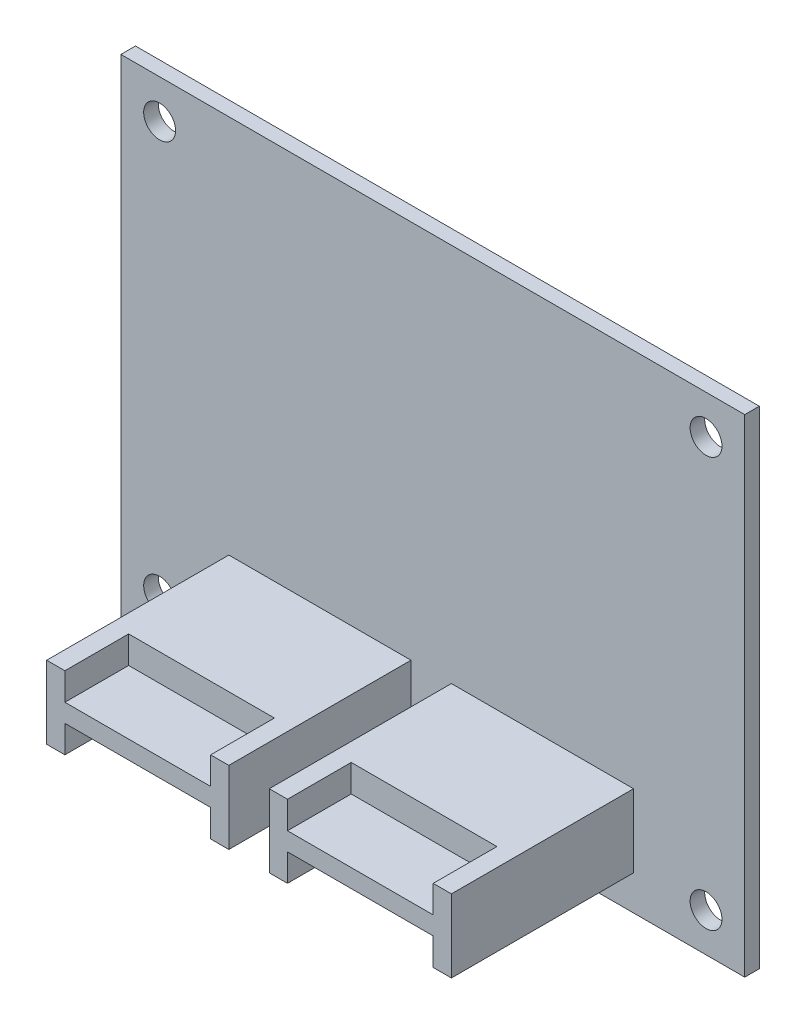
ISO-10303-21;
HEADER;
FILE_DESCRIPTION(('STEP AP214'),'2;1');
FILE_NAME('part.step','',(''),(''),'','','');
FILE_SCHEMA(('AUTOMOTIVE_DESIGN { 1 0 10303 214 1 1 1 1 }'));
ENDSEC;
DATA;
#1=APPLICATION_CONTEXT('core data for automotive mechanical design processes');
#2=APPLICATION_PROTOCOL_DEFINITION('international standard','automotive_design',2000,#1);
#3=PRODUCT_CONTEXT('',#1,'mechanical');
#4=PRODUCT('Part','Part','',(#3));
#5=PRODUCT_RELATED_PRODUCT_CATEGORY('part','',(#4));
#6=PRODUCT_DEFINITION_FORMATION('','',#4);
#7=PRODUCT_DEFINITION_CONTEXT('part definition',#1,'design');
#8=PRODUCT_DEFINITION('design','',#6,#7);
#9=PRODUCT_DEFINITION_SHAPE('','',#8);
#10=(LENGTH_UNIT() NAMED_UNIT(*) SI_UNIT(.MILLI.,.METRE.));
#11=(NAMED_UNIT(*) PLANE_ANGLE_UNIT() SI_UNIT($,.RADIAN.));
#12=(NAMED_UNIT(*) SI_UNIT($,.STERADIAN.) SOLID_ANGLE_UNIT());
#13=UNCERTAINTY_MEASURE_WITH_UNIT(LENGTH_MEASURE(1.E-05),#10,'distance_accuracy_value','');
#14=(GEOMETRIC_REPRESENTATION_CONTEXT(3) GLOBAL_UNCERTAINTY_ASSIGNED_CONTEXT((#13)) GLOBAL_UNIT_ASSIGNED_CONTEXT((#10,
#11,#12)) REPRESENTATION_CONTEXT('',''));
#15=CARTESIAN_POINT('',(0.,0.,0.));
#16=DIRECTION('',(0.,0.,1.));
#17=DIRECTION('',(1.,0.,0.));
#18=AXIS2_PLACEMENT_3D('',#15,#16,#17);
#19=CARTESIAN_POINT('',(0.,0.,0.8));
#20=DIRECTION('',(0.,0.,1.));
#21=DIRECTION('',(1.,0.,0.));
#22=AXIS2_PLACEMENT_3D('',#19,#20,#21);
#23=PLANE('',#22);
#24=CARTESIAN_POINT('',(-30.,-22.5,0.8));
#25=DIRECTION('',(0.,0.,1.));
#26=DIRECTION('',(1.,0.,0.));
#27=AXIS2_PLACEMENT_3D('',#24,#25,#26);
#28=CIRCLE('',#27,1.75);
#29=CARTESIAN_POINT('',(-28.25,-22.5,0.8));
#30=VERTEX_POINT('',#29);
#31=EDGE_CURVE('E491',#30,#30,#28,.T.);
#32=ORIENTED_EDGE('',*,*,#31,.F.);
#33=EDGE_LOOP('',(#32));
#34=FACE_BOUND('',#33,.T.);
#35=CARTESIAN_POINT('',(-30.,22.5,0.8));
#36=DIRECTION('',(0.,0.,1.));
#37=DIRECTION('',(1.,0.,0.));
#38=AXIS2_PLACEMENT_3D('',#35,#36,#37);
#39=CIRCLE('',#38,1.75);
#40=CARTESIAN_POINT('',(-28.25,22.5,0.8));
#41=VERTEX_POINT('',#40);
#42=EDGE_CURVE('E507',#41,#41,#39,.T.);
#43=ORIENTED_EDGE('',*,*,#42,.F.);
#44=EDGE_LOOP('',(#43));
#45=FACE_BOUND('',#44,.T.);
#46=DIRECTION('',(0.,-1.,0.));
#47=VECTOR('',#46,1.);
#48=CARTESIAN_POINT('',(-34.25,26.75,0.8));
#49=LINE('',#48,#47);
#50=CARTESIAN_POINT('',(-34.25,26.75,0.8));
#51=VERTEX_POINT('',#50);
#52=CARTESIAN_POINT('',(-34.25,-26.75,0.8));
#53=VERTEX_POINT('',#52);
#54=EDGE_CURVE('E515',#51,#53,#49,.T.);
#55=ORIENTED_EDGE('',*,*,#54,.T.);
#56=DIRECTION('',(1.,0.,0.));
#57=VECTOR('',#56,1.);
#58=CARTESIAN_POINT('',(-34.25,-26.75,0.8));
#59=LINE('',#58,#57);
#60=CARTESIAN_POINT('',(34.25,-26.75,0.8));
#61=VERTEX_POINT('',#60);
#62=EDGE_CURVE('E519',#53,#61,#59,.T.);
#63=ORIENTED_EDGE('',*,*,#62,.T.);
#64=DIRECTION('',(0.,1.,0.));
#65=VECTOR('',#64,1.);
#66=CARTESIAN_POINT('',(34.25,26.75,0.8));
#67=LINE('',#66,#65);
#68=CARTESIAN_POINT('',(34.25,26.75,0.8));
#69=VERTEX_POINT('',#68);
#70=EDGE_CURVE('E523',#61,#69,#67,.T.);
#71=ORIENTED_EDGE('',*,*,#70,.T.);
#72=DIRECTION('',(-1.,0.,0.));
#73=VECTOR('',#72,1.);
#74=CARTESIAN_POINT('',(-34.25,26.75,0.8));
#75=LINE('',#74,#73);
#76=EDGE_CURVE('E526',#69,#51,#75,.T.);
#77=ORIENTED_EDGE('',*,*,#76,.T.);
#78=EDGE_LOOP('',(#55,#63,#71,#77));
#79=FACE_BOUND('',#78,.T.);
#80=CARTESIAN_POINT('',(30.,22.5,0.8));
#81=DIRECTION('',(0.,0.,1.));
#82=DIRECTION('',(1.,0.,0.));
#83=AXIS2_PLACEMENT_3D('',#80,#81,#82);
#84=CIRCLE('',#83,1.75);
#85=CARTESIAN_POINT('',(31.75,22.5,0.8));
#86=VERTEX_POINT('',#85);
#87=EDGE_CURVE('E499',#86,#86,#84,.T.);
#88=ORIENTED_EDGE('',*,*,#87,.F.);
#89=EDGE_LOOP('',(#88));
#90=FACE_BOUND('',#89,.T.);
#91=CARTESIAN_POINT('',(30.,-22.5,0.8));
#92=DIRECTION('',(0.,0.,1.));
#93=DIRECTION('',(1.,0.,0.));
#94=AXIS2_PLACEMENT_3D('',#91,#92,#93);
#95=CIRCLE('',#94,1.75000000000001);
#96=CARTESIAN_POINT('',(31.75,-22.5,0.8));
#97=VERTEX_POINT('',#96);
#98=EDGE_CURVE('E483',#97,#97,#95,.T.);
#99=ORIENTED_EDGE('',*,*,#98,.F.);
#100=EDGE_LOOP('',(#99));
#101=FACE_BOUND('',#100,.T.);
#102=DIRECTION('',(1.,0.,0.));
#103=VECTOR('',#102,1.);
#104=CARTESIAN_POINT('',(-22.3993988063415,-22.9310366105022,0.8));
#105=LINE('',#104,#103);
#106=CARTESIAN_POINT('',(-22.3993988063415,-22.9310366105022,0.8));
#107=VERTEX_POINT('',#106);
#108=CARTESIAN_POINT('',(-2.39939880634145,-22.9310366105022,0.8));
#109=VERTEX_POINT('',#108);
#110=EDGE_CURVE('E460',#107,#109,#105,.T.);
#111=ORIENTED_EDGE('',*,*,#110,.F.);
#112=DIRECTION('',(0.,-1.,0.));
#113=VECTOR('',#112,1.);
#114=CARTESIAN_POINT('',(-22.3993988063415,-14.9310366105022,0.8));
#115=LINE('',#114,#113);
#116=CARTESIAN_POINT('',(-22.3993988063415,-14.9310366105022,0.8));
#117=VERTEX_POINT('',#116);
#118=EDGE_CURVE('E437',#117,#107,#115,.T.);
#119=ORIENTED_EDGE('',*,*,#118,.F.);
#120=DIRECTION('',(-1.,0.,0.));
#121=VECTOR('',#120,1.);
#122=CARTESIAN_POINT('',(-22.3993988063415,-14.9310366105022,0.8));
#123=LINE('',#122,#121);
#124=CARTESIAN_POINT('',(-2.39939880634145,-14.9310366105022,0.8));
#125=VERTEX_POINT('',#124);
#126=EDGE_CURVE('E443',#125,#117,#123,.T.);
#127=ORIENTED_EDGE('',*,*,#126,.F.);
#128=DIRECTION('',(0.,1.,0.));
#129=VECTOR('',#128,1.);
#130=CARTESIAN_POINT('',(-2.39939880634145,-14.9310366105022,0.8));
#131=LINE('',#130,#129);
#132=EDGE_CURVE('E463',#109,#125,#131,.T.);
#133=ORIENTED_EDGE('',*,*,#132,.F.);
#134=EDGE_LOOP('',(#111,#119,#127,#133));
#135=FACE_BOUND('',#134,.T.);
#136=DIRECTION('',(1.,0.,0.));
#137=VECTOR('',#136,1.);
#138=CARTESIAN_POINT('',(2.03976637548692,-22.9310366105022,0.8));
#139=LINE('',#138,#137);
#140=CARTESIAN_POINT('',(2.03976637548692,-22.9310366105022,0.8));
#141=VERTEX_POINT('',#140);
#142=CARTESIAN_POINT('',(22.0397663754869,-22.9310366105022,0.8));
#143=VERTEX_POINT('',#142);
#144=EDGE_CURVE('E415',#141,#143,#139,.T.);
#145=ORIENTED_EDGE('',*,*,#144,.F.);
#146=DIRECTION('',(0.,-1.,0.));
#147=VECTOR('',#146,1.);
#148=CARTESIAN_POINT('',(2.03976637548692,-14.9310366105022,0.8));
#149=LINE('',#148,#147);
#150=CARTESIAN_POINT('',(2.03976637548692,-14.9310366105022,0.8));
#151=VERTEX_POINT('',#150);
#152=EDGE_CURVE('E384',#151,#141,#149,.T.);
#153=ORIENTED_EDGE('',*,*,#152,.F.);
#154=DIRECTION('',(-1.,0.,0.));
#155=VECTOR('',#154,1.);
#156=CARTESIAN_POINT('',(2.03976637548692,-14.9310366105022,0.8));
#157=LINE('',#156,#155);
#158=CARTESIAN_POINT('',(22.0397663754869,-14.9310366105022,0.8));
#159=VERTEX_POINT('',#158);
#160=EDGE_CURVE('E399',#159,#151,#157,.T.);
#161=ORIENTED_EDGE('',*,*,#160,.F.);
#162=DIRECTION('',(0.,1.,0.));
#163=VECTOR('',#162,1.);
#164=CARTESIAN_POINT('',(22.0397663754869,-14.9310366105022,0.8));
#165=LINE('',#164,#163);
#166=EDGE_CURVE('E418',#143,#159,#165,.T.);
#167=ORIENTED_EDGE('',*,*,#166,.F.);
#168=EDGE_LOOP('',(#145,#153,#161,#167));
#169=FACE_BOUND('',#168,.T.);
#170=ADVANCED_FACE('F39',(#34,#45,#79,#90,#101,#135,#169),#23,.T.);
#171=CARTESIAN_POINT('',(0.,0.,-0.8));
#172=DIRECTION('',(0.,0.,1.));
#173=DIRECTION('',(1.,0.,0.));
#174=AXIS2_PLACEMENT_3D('',#171,#172,#173);
#175=PLANE('',#174);
#176=DIRECTION('',(0.,-1.,0.));
#177=VECTOR('',#176,1.);
#178=CARTESIAN_POINT('',(-34.25,26.75,-0.8));
#179=LINE('',#178,#177);
#180=CARTESIAN_POINT('',(-34.25,26.75,-0.8));
#181=VERTEX_POINT('',#180);
#182=CARTESIAN_POINT('',(-34.25,-26.75,-0.8));
#183=VERTEX_POINT('',#182);
#184=EDGE_CURVE('E511',#181,#183,#179,.T.);
#185=ORIENTED_EDGE('',*,*,#184,.F.);
#186=DIRECTION('',(-1.,0.,0.));
#187=VECTOR('',#186,1.);
#188=CARTESIAN_POINT('',(-34.25,26.75,-0.8));
#189=LINE('',#188,#187);
#190=CARTESIAN_POINT('',(34.25,26.75,-0.8));
#191=VERTEX_POINT('',#190);
#192=EDGE_CURVE('E520',#191,#181,#189,.T.);
#193=ORIENTED_EDGE('',*,*,#192,.F.);
#194=DIRECTION('',(0.,1.,0.));
#195=VECTOR('',#194,1.);
#196=CARTESIAN_POINT('',(34.25,26.75,-0.8));
#197=LINE('',#196,#195);
#198=CARTESIAN_POINT('',(34.25,-26.75,-0.8));
#199=VERTEX_POINT('',#198);
#200=EDGE_CURVE('E536',#199,#191,#197,.T.);
#201=ORIENTED_EDGE('',*,*,#200,.F.);
#202=DIRECTION('',(1.,0.,0.));
#203=VECTOR('',#202,1.);
#204=CARTESIAN_POINT('',(-34.25,-26.75,-0.8));
#205=LINE('',#204,#203);
#206=EDGE_CURVE('E533',#183,#199,#205,.T.);
#207=ORIENTED_EDGE('',*,*,#206,.F.);
#208=EDGE_LOOP('',(#185,#193,#201,#207));
#209=FACE_BOUND('',#208,.T.);
#210=CARTESIAN_POINT('',(-30.,22.5,-0.8));
#211=DIRECTION('',(0.,0.,1.));
#212=DIRECTION('',(1.,0.,0.));
#213=AXIS2_PLACEMENT_3D('',#210,#211,#212);
#214=CIRCLE('',#213,1.75);
#215=CARTESIAN_POINT('',(-28.25,22.5,-0.8));
#216=VERTEX_POINT('',#215);
#217=EDGE_CURVE('E503',#216,#216,#214,.T.);
#218=ORIENTED_EDGE('',*,*,#217,.T.);
#219=EDGE_LOOP('',(#218));
#220=FACE_BOUND('',#219,.T.);
#221=CARTESIAN_POINT('',(30.,22.5,-0.8));
#222=DIRECTION('',(0.,0.,1.));
#223=DIRECTION('',(1.,0.,0.));
#224=AXIS2_PLACEMENT_3D('',#221,#222,#223);
#225=CIRCLE('',#224,1.75);
#226=CARTESIAN_POINT('',(31.75,22.5,-0.8));
#227=VERTEX_POINT('',#226);
#228=EDGE_CURVE('E495',#227,#227,#225,.T.);
#229=ORIENTED_EDGE('',*,*,#228,.T.);
#230=EDGE_LOOP('',(#229));
#231=FACE_BOUND('',#230,.T.);
#232=CARTESIAN_POINT('',(-30.,-22.5,-0.8));
#233=DIRECTION('',(0.,0.,1.));
#234=DIRECTION('',(1.,0.,0.));
#235=AXIS2_PLACEMENT_3D('',#232,#233,#234);
#236=CIRCLE('',#235,1.75);
#237=CARTESIAN_POINT('',(-28.25,-22.5,-0.8));
#238=VERTEX_POINT('',#237);
#239=EDGE_CURVE('E487',#238,#238,#236,.T.);
#240=ORIENTED_EDGE('',*,*,#239,.T.);
#241=EDGE_LOOP('',(#240));
#242=FACE_BOUND('',#241,.T.);
#243=CARTESIAN_POINT('',(30.,-22.5,-0.8));
#244=DIRECTION('',(0.,0.,1.));
#245=DIRECTION('',(1.,0.,0.));
#246=AXIS2_PLACEMENT_3D('',#243,#244,#245);
#247=CIRCLE('',#246,1.75000000000001);
#248=CARTESIAN_POINT('',(31.75,-22.5,-0.8));
#249=VERTEX_POINT('',#248);
#250=EDGE_CURVE('E482',#249,#249,#247,.T.);
#251=ORIENTED_EDGE('',*,*,#250,.T.);
#252=EDGE_LOOP('',(#251));
#253=FACE_BOUND('',#252,.T.);
#254=ADVANCED_FACE('F559',(#209,#220,#231,#242,#253),#175,.F.);
#255=CARTESIAN_POINT('',(-34.25,26.75,0.8));
#256=DIRECTION('',(1.,0.,0.));
#257=DIRECTION('',(0.,1.,0.));
#258=AXIS2_PLACEMENT_3D('',#255,#256,#257);
#259=PLANE('',#258);
#260=ORIENTED_EDGE('',*,*,#184,.T.);
#261=DIRECTION('',(0.,0.,-1.));
#262=VECTOR('',#261,1.);
#263=CARTESIAN_POINT('',(-34.25,-26.75,0.8));
#264=LINE('',#263,#262);
#265=EDGE_CURVE('E11',#53,#183,#264,.T.);
#266=ORIENTED_EDGE('',*,*,#265,.F.);
#267=ORIENTED_EDGE('',*,*,#54,.F.);
#268=DIRECTION('',(0.,0.,-1.));
#269=VECTOR('',#268,1.);
#270=CARTESIAN_POINT('',(-34.25,26.75,0.8));
#271=LINE('',#270,#269);
#272=EDGE_CURVE('E529',#51,#181,#271,.T.);
#273=ORIENTED_EDGE('',*,*,#272,.T.);
#274=EDGE_LOOP('',(#260,#266,#267,#273));
#275=FACE_BOUND('',#274,.T.);
#276=ADVANCED_FACE('F41',(#275),#259,.F.);
#277=CARTESIAN_POINT('',(-34.25,-26.75,0.8));
#278=DIRECTION('',(0.,1.,0.));
#279=DIRECTION('',(0.,0.,1.));
#280=AXIS2_PLACEMENT_3D('',#277,#278,#279);
#281=PLANE('',#280);
#282=ORIENTED_EDGE('',*,*,#206,.T.);
#283=DIRECTION('',(0.,0.,-1.));
#284=VECTOR('',#283,1.);
#285=CARTESIAN_POINT('',(34.25,-26.75,0.8));
#286=LINE('',#285,#284);
#287=EDGE_CURVE('E48',#61,#199,#286,.T.);
#288=ORIENTED_EDGE('',*,*,#287,.F.);
#289=ORIENTED_EDGE('',*,*,#62,.F.);
#290=ORIENTED_EDGE('',*,*,#265,.T.);
#291=EDGE_LOOP('',(#282,#288,#289,#290));
#292=FACE_BOUND('',#291,.T.);
#293=ADVANCED_FACE('F570',(#292),#281,.F.);
#294=CARTESIAN_POINT('',(34.25,26.75,0.8));
#295=DIRECTION('',(-1.,0.,0.));
#296=DIRECTION('',(0.,0.,1.));
#297=AXIS2_PLACEMENT_3D('',#294,#295,#296);
#298=PLANE('',#297);
#299=ORIENTED_EDGE('',*,*,#200,.T.);
#300=DIRECTION('',(0.,0.,-1.));
#301=VECTOR('',#300,1.);
#302=CARTESIAN_POINT('',(34.25,26.75,0.8));
#303=LINE('',#302,#301);
#304=EDGE_CURVE('E544',#69,#191,#303,.T.);
#305=ORIENTED_EDGE('',*,*,#304,.F.);
#306=ORIENTED_EDGE('',*,*,#70,.F.);
#307=ORIENTED_EDGE('',*,*,#287,.T.);
#308=EDGE_LOOP('',(#299,#305,#306,#307));
#309=FACE_BOUND('',#308,.T.);
#310=ADVANCED_FACE('F553',(#309),#298,.F.);
#311=CARTESIAN_POINT('',(-34.25,26.75,0.8));
#312=DIRECTION('',(0.,-1.,0.));
#313=DIRECTION('',(0.,0.,-1.));
#314=AXIS2_PLACEMENT_3D('',#311,#312,#313);
#315=PLANE('',#314);
#316=ORIENTED_EDGE('',*,*,#192,.T.);
#317=ORIENTED_EDGE('',*,*,#272,.F.);
#318=ORIENTED_EDGE('',*,*,#76,.F.);
#319=ORIENTED_EDGE('',*,*,#304,.T.);
#320=EDGE_LOOP('',(#316,#317,#318,#319));
#321=FACE_BOUND('',#320,.T.);
#322=ADVANCED_FACE('F563',(#321),#315,.F.);
#323=CARTESIAN_POINT('',(-30.,22.5,0.8));
#324=DIRECTION('',(0.,0.,-1.));
#325=DIRECTION('',(-1.,0.,0.));
#326=AXIS2_PLACEMENT_3D('',#323,#324,#325);
#327=CYLINDRICAL_SURFACE('',#326,1.75);
#328=ORIENTED_EDGE('',*,*,#42,.T.);
#329=EDGE_LOOP('',(#328));
#330=FACE_BOUND('',#329,.T.);
#331=ORIENTED_EDGE('',*,*,#217,.F.);
#332=EDGE_LOOP('',(#331));
#333=FACE_BOUND('',#332,.T.);
#334=ADVANCED_FACE('F587',(#330,#333),#327,.F.);
#335=CARTESIAN_POINT('',(30.,22.5,0.8));
#336=DIRECTION('',(0.,0.,-1.));
#337=DIRECTION('',(-1.,0.,0.));
#338=AXIS2_PLACEMENT_3D('',#335,#336,#337);
#339=CYLINDRICAL_SURFACE('',#338,1.75);
#340=ORIENTED_EDGE('',*,*,#87,.T.);
#341=EDGE_LOOP('',(#340));
#342=FACE_BOUND('',#341,.T.);
#343=ORIENTED_EDGE('',*,*,#228,.F.);
#344=EDGE_LOOP('',(#343));
#345=FACE_BOUND('',#344,.T.);
#346=ADVANCED_FACE('F594',(#342,#345),#339,.F.);
#347=CARTESIAN_POINT('',(-30.,-22.5,0.8));
#348=DIRECTION('',(0.,0.,-1.));
#349=DIRECTION('',(-1.,0.,0.));
#350=AXIS2_PLACEMENT_3D('',#347,#348,#349);
#351=CYLINDRICAL_SURFACE('',#350,1.75);
#352=ORIENTED_EDGE('',*,*,#31,.T.);
#353=EDGE_LOOP('',(#352));
#354=FACE_BOUND('',#353,.T.);
#355=ORIENTED_EDGE('',*,*,#239,.F.);
#356=EDGE_LOOP('',(#355));
#357=FACE_BOUND('',#356,.T.);
#358=ADVANCED_FACE('F599',(#354,#357),#351,.F.);
#359=CARTESIAN_POINT('',(30.,-22.5,0.8));
#360=DIRECTION('',(0.,0.,-1.));
#361=DIRECTION('',(-1.,0.,0.));
#362=AXIS2_PLACEMENT_3D('',#359,#360,#361);
#363=CYLINDRICAL_SURFACE('',#362,1.75000000000001);
#364=ORIENTED_EDGE('',*,*,#98,.T.);
#365=EDGE_LOOP('',(#364));
#366=FACE_BOUND('',#365,.T.);
#367=ORIENTED_EDGE('',*,*,#250,.F.);
#368=EDGE_LOOP('',(#367));
#369=FACE_BOUND('',#368,.T.);
#370=ADVANCED_FACE('F611',(#366,#369),#363,.F.);
#371=CARTESIAN_POINT('',(-22.3993988063415,-14.9310366105022,20.8));
#372=DIRECTION('',(1.,0.,0.));
#373=DIRECTION('',(0.,0.,-1.));
#374=AXIS2_PLACEMENT_3D('',#371,#372,#373);
#375=PLANE('',#374);
#376=ORIENTED_EDGE('',*,*,#118,.T.);
#377=DIRECTION('',(0.,0.,-1.));
#378=VECTOR('',#377,1.);
#379=CARTESIAN_POINT('',(-22.3993988063415,-22.9310366105022,20.8));
#380=LINE('',#379,#378);
#381=CARTESIAN_POINT('',(-22.3993988063415,-22.9310366105022,20.8));
#382=VERTEX_POINT('',#381);
#383=EDGE_CURVE('E479',#382,#107,#380,.T.);
#384=ORIENTED_EDGE('',*,*,#383,.F.);
#385=DIRECTION('',(0.,-1.,0.));
#386=VECTOR('',#385,1.);
#387=CARTESIAN_POINT('',(-22.3993988063415,-14.9310366105022,20.8));
#388=LINE('',#387,#386);
#389=CARTESIAN_POINT('',(-22.3993988063415,-14.9310366105022,20.8));
#390=VERTEX_POINT('',#389);
#391=EDGE_CURVE('E438',#390,#382,#388,.T.);
#392=ORIENTED_EDGE('',*,*,#391,.F.);
#393=DIRECTION('',(0.,0.,-1.));
#394=VECTOR('',#393,1.);
#395=CARTESIAN_POINT('',(-22.3993988063415,-14.9310366105022,20.8));
#396=LINE('',#395,#394);
#397=EDGE_CURVE('E456',#390,#117,#396,.T.);
#398=ORIENTED_EDGE('',*,*,#397,.T.);
#399=EDGE_LOOP('',(#376,#384,#392,#398));
#400=FACE_BOUND('',#399,.T.);
#401=ADVANCED_FACE('F613',(#400),#375,.F.);
#402=CARTESIAN_POINT('',(-22.3993988063415,-22.9310366105022,20.8));
#403=DIRECTION('',(0.,1.,0.));
#404=DIRECTION('',(0.,0.,1.));
#405=AXIS2_PLACEMENT_3D('',#402,#403,#404);
#406=PLANE('',#405);
#407=DIRECTION('',(1.,0.,0.));
#408=VECTOR('',#407,1.);
#409=CARTESIAN_POINT('',(-20.3993988063415,-22.9310366105022,13.8));
#410=LINE('',#409,#408);
#411=CARTESIAN_POINT('',(-20.3993988063415,-22.9310366105022,13.8));
#412=VERTEX_POINT('',#411);
#413=CARTESIAN_POINT('',(-4.39939880634145,-22.9310366105022,13.8));
#414=VERTEX_POINT('',#413);
#415=EDGE_CURVE('E282',#412,#414,#410,.T.);
#416=ORIENTED_EDGE('',*,*,#415,.F.);
#417=DIRECTION('',(0.,0.,1.));
#418=VECTOR('',#417,1.);
#419=CARTESIAN_POINT('',(-20.3993988063415,-22.9310366105022,13.8));
#420=LINE('',#419,#418);
#421=CARTESIAN_POINT('',(-20.3993988063415,-22.9310366105022,20.8));
#422=VERTEX_POINT('',#421);
#423=EDGE_CURVE('E295',#412,#422,#420,.T.);
#424=ORIENTED_EDGE('',*,*,#423,.T.);
#425=DIRECTION('',(1.,0.,0.));
#426=VECTOR('',#425,1.);
#427=CARTESIAN_POINT('',(-22.3993988063415,-22.9310366105022,20.8));
#428=LINE('',#427,#426);
#429=EDGE_CURVE('E444',#382,#422,#428,.T.);
#430=ORIENTED_EDGE('',*,*,#429,.F.);
#431=ORIENTED_EDGE('',*,*,#383,.T.);
#432=ORIENTED_EDGE('',*,*,#110,.T.);
#433=DIRECTION('',(0.,0.,-1.));
#434=VECTOR('',#433,1.);
#435=CARTESIAN_POINT('',(-2.39939880634145,-22.9310366105022,20.8));
#436=LINE('',#435,#434);
#437=CARTESIAN_POINT('',(-2.39939880634145,-22.9310366105022,20.8));
#438=VERTEX_POINT('',#437);
#439=EDGE_CURVE('E475',#438,#109,#436,.T.);
#440=ORIENTED_EDGE('',*,*,#439,.F.);
#441=CARTESIAN_POINT('',(-4.39939880634145,-22.9310366105022,20.8));
#442=VERTEX_POINT('',#441);
#443=EDGE_CURVE('E442',#442,#438,#428,.T.);
#444=ORIENTED_EDGE('',*,*,#443,.F.);
#445=DIRECTION('',(0.,0.,1.));
#446=VECTOR('',#445,1.);
#447=CARTESIAN_POINT('',(-4.39939880634145,-22.9310366105022,13.8));
#448=LINE('',#447,#446);
#449=EDGE_CURVE('E63',#414,#442,#448,.T.);
#450=ORIENTED_EDGE('',*,*,#449,.F.);
#451=EDGE_LOOP('',(#416,#424,#430,#431,#432,#440,#444,#450));
#452=FACE_BOUND('',#451,.T.);
#453=ADVANCED_FACE('F620',(#452),#406,.F.);
#454=CARTESIAN_POINT('',(-2.39939880634145,-14.9310366105022,20.8));
#455=DIRECTION('',(-1.,0.,0.));
#456=DIRECTION('',(0.,0.,1.));
#457=AXIS2_PLACEMENT_3D('',#454,#455,#456);
#458=PLANE('',#457);
#459=ORIENTED_EDGE('',*,*,#132,.T.);
#460=DIRECTION('',(0.,0.,-1.));
#461=VECTOR('',#460,1.);
#462=CARTESIAN_POINT('',(-2.39939880634145,-14.9310366105022,20.8));
#463=LINE('',#462,#461);
#464=CARTESIAN_POINT('',(-2.39939880634145,-14.9310366105022,20.8));
#465=VERTEX_POINT('',#464);
#466=EDGE_CURVE('E472',#465,#125,#463,.T.);
#467=ORIENTED_EDGE('',*,*,#466,.F.);
#468=DIRECTION('',(0.,1.,0.));
#469=VECTOR('',#468,1.);
#470=CARTESIAN_POINT('',(-2.39939880634145,-14.9310366105022,20.8));
#471=LINE('',#470,#469);
#472=EDGE_CURVE('E448',#438,#465,#471,.T.);
#473=ORIENTED_EDGE('',*,*,#472,.F.);
#474=ORIENTED_EDGE('',*,*,#439,.T.);
#475=EDGE_LOOP('',(#459,#467,#473,#474));
#476=FACE_BOUND('',#475,.T.);
#477=ADVANCED_FACE('F628',(#476),#458,.F.);
#478=CARTESIAN_POINT('',(-22.3993988063415,-14.9310366105022,20.8));
#479=DIRECTION('',(0.,-1.,0.));
#480=DIRECTION('',(0.,0.,-1.));
#481=AXIS2_PLACEMENT_3D('',#478,#479,#480);
#482=PLANE('',#481);
#483=DIRECTION('',(-1.,0.,0.));
#484=VECTOR('',#483,1.);
#485=CARTESIAN_POINT('',(-22.3993988063415,-14.9310366105022,20.8));
#486=LINE('',#485,#484);
#487=CARTESIAN_POINT('',(-20.3993988063415,-14.9310366105022,20.8));
#488=VERTEX_POINT('',#487);
#489=EDGE_CURVE('E451',#488,#390,#486,.T.);
#490=ORIENTED_EDGE('',*,*,#489,.F.);
#491=DIRECTION('',(0.,0.,1.));
#492=VECTOR('',#491,1.);
#493=CARTESIAN_POINT('',(-20.3993988063415,-14.9310366105022,13.8));
#494=LINE('',#493,#492);
#495=CARTESIAN_POINT('',(-20.3993988063415,-14.9310366105022,13.8));
#496=VERTEX_POINT('',#495);
#497=EDGE_CURVE('E381',#496,#488,#494,.T.);
#498=ORIENTED_EDGE('',*,*,#497,.F.);
#499=DIRECTION('',(-1.,0.,0.));
#500=VECTOR('',#499,1.);
#501=CARTESIAN_POINT('',(-20.3993988063415,-14.9310366105022,13.8));
#502=LINE('',#501,#500);
#503=CARTESIAN_POINT('',(-4.39939880634145,-14.9310366105022,13.8));
#504=VERTEX_POINT('',#503);
#505=EDGE_CURVE('E368',#504,#496,#502,.T.);
#506=ORIENTED_EDGE('',*,*,#505,.F.);
#507=DIRECTION('',(0.,0.,1.));
#508=VECTOR('',#507,1.);
#509=CARTESIAN_POINT('',(-4.39939880634145,-14.9310366105022,13.8));
#510=LINE('',#509,#508);
#511=CARTESIAN_POINT('',(-4.39939880634145,-14.9310366105022,20.8));
#512=VERTEX_POINT('',#511);
#513=EDGE_CURVE('E385',#504,#512,#510,.T.);
#514=ORIENTED_EDGE('',*,*,#513,.T.);
#515=EDGE_CURVE('E452',#465,#512,#486,.T.);
#516=ORIENTED_EDGE('',*,*,#515,.F.);
#517=ORIENTED_EDGE('',*,*,#466,.T.);
#518=ORIENTED_EDGE('',*,*,#126,.T.);
#519=ORIENTED_EDGE('',*,*,#397,.F.);
#520=EDGE_LOOP('',(#490,#498,#506,#514,#516,#517,#518,#519));
#521=FACE_BOUND('',#520,.T.);
#522=ADVANCED_FACE('F632',(#521),#482,.F.);
#523=CARTESIAN_POINT('',(0.,0.,20.8));
#524=DIRECTION('',(0.,0.,1.));
#525=DIRECTION('',(1.,0.,0.));
#526=AXIS2_PLACEMENT_3D('',#523,#524,#525);
#527=PLANE('',#526);
#528=DIRECTION('',(0.,-1.,0.));
#529=VECTOR('',#528,1.);
#530=CARTESIAN_POINT('',(-20.3993988063415,-22.9310366105022,20.8));
#531=LINE('',#530,#529);
#532=CARTESIAN_POINT('',(-20.3993988063415,-19.9310366105022,20.8));
#533=VERTEX_POINT('',#532);
#534=EDGE_CURVE('E296',#533,#422,#531,.T.);
#535=ORIENTED_EDGE('',*,*,#534,.F.);
#536=DIRECTION('',(-1.,0.,0.));
#537=VECTOR('',#536,1.);
#538=CARTESIAN_POINT('',(-20.3993988063415,-19.9310366105022,20.8));
#539=LINE('',#538,#537);
#540=CARTESIAN_POINT('',(-4.39939880634145,-19.9310366105022,20.8));
#541=VERTEX_POINT('',#540);
#542=EDGE_CURVE('E283',#541,#533,#539,.T.);
#543=ORIENTED_EDGE('',*,*,#542,.F.);
#544=DIRECTION('',(0.,1.,0.));
#545=VECTOR('',#544,1.);
#546=CARTESIAN_POINT('',(-4.39939880634145,-22.9310366105022,20.8));
#547=LINE('',#546,#545);
#548=EDGE_CURVE('E299',#442,#541,#547,.T.);
#549=ORIENTED_EDGE('',*,*,#548,.F.);
#550=ORIENTED_EDGE('',*,*,#443,.T.);
#551=ORIENTED_EDGE('',*,*,#472,.T.);
#552=ORIENTED_EDGE('',*,*,#515,.T.);
#553=DIRECTION('',(0.,1.,0.));
#554=VECTOR('',#553,1.);
#555=CARTESIAN_POINT('',(-4.39939880634145,-14.9310366105022,20.8));
#556=LINE('',#555,#554);
#557=CARTESIAN_POINT('',(-4.39939880634145,-17.9310366105022,20.8));
#558=VERTEX_POINT('',#557);
#559=EDGE_CURVE('E360',#558,#512,#556,.T.);
#560=ORIENTED_EDGE('',*,*,#559,.F.);
#561=DIRECTION('',(1.,0.,0.));
#562=VECTOR('',#561,1.);
#563=CARTESIAN_POINT('',(-20.3993988063415,-17.9310366105022,20.8));
#564=LINE('',#563,#562);
#565=CARTESIAN_POINT('',(-20.3993988063415,-17.9310366105022,20.8));
#566=VERTEX_POINT('',#565);
#567=EDGE_CURVE('E375',#566,#558,#564,.T.);
#568=ORIENTED_EDGE('',*,*,#567,.F.);
#569=DIRECTION('',(0.,-1.,0.));
#570=VECTOR('',#569,1.);
#571=CARTESIAN_POINT('',(-20.3993988063415,-14.9310366105022,20.8));
#572=LINE('',#571,#570);
#573=EDGE_CURVE('E55',#488,#566,#572,.T.);
#574=ORIENTED_EDGE('',*,*,#573,.F.);
#575=ORIENTED_EDGE('',*,*,#489,.T.);
#576=ORIENTED_EDGE('',*,*,#391,.T.);
#577=ORIENTED_EDGE('',*,*,#429,.T.);
#578=EDGE_LOOP('',(#535,#543,#549,#550,#551,#552,#560,#568,#574,#575,#576,#577));
#579=FACE_BOUND('',#578,.T.);
#580=ADVANCED_FACE('F636',(#579),#527,.T.);
#581=CARTESIAN_POINT('',(2.03976637548692,-14.9310366105022,20.8));
#582=DIRECTION('',(1.,0.,0.));
#583=DIRECTION('',(0.,1.,0.));
#584=AXIS2_PLACEMENT_3D('',#581,#582,#583);
#585=PLANE('',#584);
#586=ORIENTED_EDGE('',*,*,#152,.T.);
#587=DIRECTION('',(0.,0.,-1.));
#588=VECTOR('',#587,1.);
#589=CARTESIAN_POINT('',(2.03976637548692,-22.9310366105022,20.8));
#590=LINE('',#589,#588);
#591=CARTESIAN_POINT('',(2.03976637548692,-22.9310366105022,20.8));
#592=VERTEX_POINT('',#591);
#593=EDGE_CURVE('E434',#592,#141,#590,.T.);
#594=ORIENTED_EDGE('',*,*,#593,.F.);
#595=DIRECTION('',(0.,-1.,0.));
#596=VECTOR('',#595,1.);
#597=CARTESIAN_POINT('',(2.03976637548692,-14.9310366105022,20.8));
#598=LINE('',#597,#596);
#599=CARTESIAN_POINT('',(2.03976637548692,-14.9310366105022,20.8));
#600=VERTEX_POINT('',#599);
#601=EDGE_CURVE('E394',#600,#592,#598,.T.);
#602=ORIENTED_EDGE('',*,*,#601,.F.);
#603=DIRECTION('',(0.,0.,-1.));
#604=VECTOR('',#603,1.);
#605=CARTESIAN_POINT('',(2.03976637548692,-14.9310366105022,20.8));
#606=LINE('',#605,#604);
#607=EDGE_CURVE('E411',#600,#151,#606,.T.);
#608=ORIENTED_EDGE('',*,*,#607,.T.);
#609=EDGE_LOOP('',(#586,#594,#602,#608));
#610=FACE_BOUND('',#609,.T.);
#611=ADVANCED_FACE('F640',(#610),#585,.F.);
#612=CARTESIAN_POINT('',(2.03976637548692,-22.9310366105022,20.8));
#613=DIRECTION('',(0.,1.,0.));
#614=DIRECTION('',(0.,0.,1.));
#615=AXIS2_PLACEMENT_3D('',#612,#613,#614);
#616=PLANE('',#615);
#617=DIRECTION('',(1.,0.,0.));
#618=VECTOR('',#617,1.);
#619=CARTESIAN_POINT('',(4.03976637548692,-22.9310366105022,13.8));
#620=LINE('',#619,#618);
#621=CARTESIAN_POINT('',(4.03976637548692,-22.9310366105022,13.8));
#622=VERTEX_POINT('',#621);
#623=CARTESIAN_POINT('',(20.0397663754869,-22.9310366105022,13.8));
#624=VERTEX_POINT('',#623);
#625=EDGE_CURVE('E244',#622,#624,#620,.T.);
#626=ORIENTED_EDGE('',*,*,#625,.F.);
#627=DIRECTION('',(0.,0.,1.));
#628=VECTOR('',#627,1.);
#629=CARTESIAN_POINT('',(4.03976637548692,-22.9310366105022,13.8));
#630=LINE('',#629,#628);
#631=CARTESIAN_POINT('',(4.03976637548692,-22.9310366105022,20.8));
#632=VERTEX_POINT('',#631);
#633=EDGE_CURVE('E226',#622,#632,#630,.T.);
#634=ORIENTED_EDGE('',*,*,#633,.T.);
#635=DIRECTION('',(1.,0.,0.));
#636=VECTOR('',#635,1.);
#637=CARTESIAN_POINT('',(2.03976637548692,-22.9310366105022,20.8));
#638=LINE('',#637,#636);
#639=EDGE_CURVE('E400',#592,#632,#638,.T.);
#640=ORIENTED_EDGE('',*,*,#639,.F.);
#641=ORIENTED_EDGE('',*,*,#593,.T.);
#642=ORIENTED_EDGE('',*,*,#144,.T.);
#643=DIRECTION('',(0.,0.,-1.));
#644=VECTOR('',#643,1.);
#645=CARTESIAN_POINT('',(22.0397663754869,-22.9310366105022,20.8));
#646=LINE('',#645,#644);
#647=CARTESIAN_POINT('',(22.0397663754869,-22.9310366105022,20.8));
#648=VERTEX_POINT('',#647);
#649=EDGE_CURVE('E430',#648,#143,#646,.T.);
#650=ORIENTED_EDGE('',*,*,#649,.F.);
#651=CARTESIAN_POINT('',(20.0397663754869,-22.9310366105022,20.8));
#652=VERTEX_POINT('',#651);
#653=EDGE_CURVE('E398',#652,#648,#638,.T.);
#654=ORIENTED_EDGE('',*,*,#653,.F.);
#655=DIRECTION('',(0.,0.,1.));
#656=VECTOR('',#655,1.);
#657=CARTESIAN_POINT('',(20.0397663754869,-22.9310366105022,13.8));
#658=LINE('',#657,#656);
#659=EDGE_CURVE('E237',#624,#652,#658,.T.);
#660=ORIENTED_EDGE('',*,*,#659,.F.);
#661=EDGE_LOOP('',(#626,#634,#640,#641,#642,#650,#654,#660));
#662=FACE_BOUND('',#661,.T.);
#663=ADVANCED_FACE('F250',(#662),#616,.F.);
#664=CARTESIAN_POINT('',(22.0397663754869,-14.9310366105022,20.8));
#665=DIRECTION('',(-1.,0.,0.));
#666=DIRECTION('',(0.,-1.,0.));
#667=AXIS2_PLACEMENT_3D('',#664,#665,#666);
#668=PLANE('',#667);
#669=ORIENTED_EDGE('',*,*,#166,.T.);
#670=DIRECTION('',(0.,0.,-1.));
#671=VECTOR('',#670,1.);
#672=CARTESIAN_POINT('',(22.0397663754869,-14.9310366105022,20.8));
#673=LINE('',#672,#671);
#674=CARTESIAN_POINT('',(22.0397663754869,-14.9310366105022,20.8));
#675=VERTEX_POINT('',#674);
#676=EDGE_CURVE('E427',#675,#159,#673,.T.);
#677=ORIENTED_EDGE('',*,*,#676,.F.);
#678=DIRECTION('',(0.,1.,0.));
#679=VECTOR('',#678,1.);
#680=CARTESIAN_POINT('',(22.0397663754869,-14.9310366105022,20.8));
#681=LINE('',#680,#679);
#682=EDGE_CURVE('E403',#648,#675,#681,.T.);
#683=ORIENTED_EDGE('',*,*,#682,.F.);
#684=ORIENTED_EDGE('',*,*,#649,.T.);
#685=EDGE_LOOP('',(#669,#677,#683,#684));
#686=FACE_BOUND('',#685,.T.);
#687=ADVANCED_FACE('F647',(#686),#668,.F.);
#688=CARTESIAN_POINT('',(2.03976637548692,-14.9310366105022,20.8));
#689=DIRECTION('',(0.,-1.,0.));
#690=DIRECTION('',(0.,0.,-1.));
#691=AXIS2_PLACEMENT_3D('',#688,#689,#690);
#692=PLANE('',#691);
#693=DIRECTION('',(-1.,0.,0.));
#694=VECTOR('',#693,1.);
#695=CARTESIAN_POINT('',(2.03976637548692,-14.9310366105022,20.8));
#696=LINE('',#695,#694);
#697=CARTESIAN_POINT('',(4.03976637548692,-14.9310366105022,20.8));
#698=VERTEX_POINT('',#697);
#699=EDGE_CURVE('E406',#698,#600,#696,.T.);
#700=ORIENTED_EDGE('',*,*,#699,.F.);
#701=DIRECTION('',(0.,0.,1.));
#702=VECTOR('',#701,1.);
#703=CARTESIAN_POINT('',(4.03976637548692,-14.9310366105022,13.8));
#704=LINE('',#703,#702);
#705=CARTESIAN_POINT('',(4.03976637548692,-14.9310366105022,13.8));
#706=VERTEX_POINT('',#705);
#707=EDGE_CURVE('E300',#706,#698,#704,.T.);
#708=ORIENTED_EDGE('',*,*,#707,.F.);
#709=DIRECTION('',(-1.,0.,0.));
#710=VECTOR('',#709,1.);
#711=CARTESIAN_POINT('',(4.03976637548692,-14.9310366105022,13.8));
#712=LINE('',#711,#710);
#713=CARTESIAN_POINT('',(20.0397663754869,-14.9310366105022,13.8));
#714=VERTEX_POINT('',#713);
#715=EDGE_CURVE('E330',#714,#706,#712,.T.);
#716=ORIENTED_EDGE('',*,*,#715,.F.);
#717=DIRECTION('',(0.,0.,1.));
#718=VECTOR('',#717,1.);
#719=CARTESIAN_POINT('',(20.0397663754869,-14.9310366105022,13.8));
#720=LINE('',#719,#718);
#721=CARTESIAN_POINT('',(20.0397663754869,-14.9310366105022,20.8));
#722=VERTEX_POINT('',#721);
#723=EDGE_CURVE('E345',#714,#722,#720,.T.);
#724=ORIENTED_EDGE('',*,*,#723,.T.);
#725=EDGE_CURVE('E407',#675,#722,#696,.T.);
#726=ORIENTED_EDGE('',*,*,#725,.F.);
#727=ORIENTED_EDGE('',*,*,#676,.T.);
#728=ORIENTED_EDGE('',*,*,#160,.T.);
#729=ORIENTED_EDGE('',*,*,#607,.F.);
#730=EDGE_LOOP('',(#700,#708,#716,#724,#726,#727,#728,#729));
#731=FACE_BOUND('',#730,.T.);
#732=ADVANCED_FACE('F650',(#731),#692,.F.);
#733=CARTESIAN_POINT('',(0.,0.,20.8));
#734=DIRECTION('',(0.,0.,1.));
#735=DIRECTION('',(1.,0.,0.));
#736=AXIS2_PLACEMENT_3D('',#733,#734,#735);
#737=PLANE('',#736);
#738=DIRECTION('',(0.,-1.,0.));
#739=VECTOR('',#738,1.);
#740=CARTESIAN_POINT('',(4.03976637548692,-14.9310366105022,20.8));
#741=LINE('',#740,#739);
#742=CARTESIAN_POINT('',(4.03976637548692,-17.9310366105022,20.8));
#743=VERTEX_POINT('',#742);
#744=EDGE_CURVE('E272',#698,#743,#741,.T.);
#745=ORIENTED_EDGE('',*,*,#744,.F.);
#746=ORIENTED_EDGE('',*,*,#699,.T.);
#747=ORIENTED_EDGE('',*,*,#601,.T.);
#748=ORIENTED_EDGE('',*,*,#639,.T.);
#749=DIRECTION('',(0.,-1.,0.));
#750=VECTOR('',#749,1.);
#751=CARTESIAN_POINT('',(4.03976637548692,-22.9310366105022,20.8));
#752=LINE('',#751,#750);
#753=CARTESIAN_POINT('',(4.03976637548692,-19.9310366105022,20.8));
#754=VERTEX_POINT('',#753);
#755=EDGE_CURVE('E232',#754,#632,#752,.T.);
#756=ORIENTED_EDGE('',*,*,#755,.F.);
#757=DIRECTION('',(-1.,0.,0.));
#758=VECTOR('',#757,1.);
#759=CARTESIAN_POINT('',(4.03976637548692,-19.9310366105022,20.8));
#760=LINE('',#759,#758);
#761=CARTESIAN_POINT('',(20.0397663754869,-19.9310366105022,20.8));
#762=VERTEX_POINT('',#761);
#763=EDGE_CURVE('E248',#762,#754,#760,.T.);
#764=ORIENTED_EDGE('',*,*,#763,.F.);
#765=DIRECTION('',(0.,1.,0.));
#766=VECTOR('',#765,1.);
#767=CARTESIAN_POINT('',(20.0397663754869,-22.9310366105022,20.8));
#768=LINE('',#767,#766);
#769=EDGE_CURVE('E262',#652,#762,#768,.T.);
#770=ORIENTED_EDGE('',*,*,#769,.F.);
#771=ORIENTED_EDGE('',*,*,#653,.T.);
#772=ORIENTED_EDGE('',*,*,#682,.T.);
#773=ORIENTED_EDGE('',*,*,#725,.T.);
#774=DIRECTION('',(0.,1.,0.));
#775=VECTOR('',#774,1.);
#776=CARTESIAN_POINT('',(20.0397663754869,-14.9310366105022,20.8));
#777=LINE('',#776,#775);
#778=CARTESIAN_POINT('',(20.0397663754869,-17.9310366105022,20.8));
#779=VERTEX_POINT('',#778);
#780=EDGE_CURVE('E322',#779,#722,#777,.T.);
#781=ORIENTED_EDGE('',*,*,#780,.F.);
#782=DIRECTION('',(1.,0.,0.));
#783=VECTOR('',#782,1.);
#784=CARTESIAN_POINT('',(4.03976637548692,-17.9310366105022,20.8));
#785=LINE('',#784,#783);
#786=EDGE_CURVE('E337',#743,#779,#785,.T.);
#787=ORIENTED_EDGE('',*,*,#786,.F.);
#788=EDGE_LOOP('',(#745,#746,#747,#748,#756,#764,#770,#771,#772,#773,#781,#787));
#789=FACE_BOUND('',#788,.T.);
#790=ADVANCED_FACE('F654',(#789),#737,.T.);
#791=CARTESIAN_POINT('',(4.03976637548692,-22.9310366105022,13.8));
#792=DIRECTION('',(-1.,0.,0.));
#793=DIRECTION('',(0.,0.,1.));
#794=AXIS2_PLACEMENT_3D('',#791,#792,#793);
#795=PLANE('',#794);
#796=ORIENTED_EDGE('',*,*,#755,.T.);
#797=ORIENTED_EDGE('',*,*,#633,.F.);
#798=DIRECTION('',(0.,-1.,0.));
#799=VECTOR('',#798,1.);
#800=CARTESIAN_POINT('',(4.03976637548692,-22.9310366105022,13.8));
#801=LINE('',#800,#799);
#802=CARTESIAN_POINT('',(4.03976637548692,-19.9310366105022,13.8));
#803=VERTEX_POINT('',#802);
#804=EDGE_CURVE('E229',#803,#622,#801,.T.);
#805=ORIENTED_EDGE('',*,*,#804,.F.);
#806=DIRECTION('',(0.,0.,1.));
#807=VECTOR('',#806,1.);
#808=CARTESIAN_POINT('',(4.03976637548692,-19.9310366105022,13.8));
#809=LINE('',#808,#807);
#810=EDGE_CURVE('E269',#803,#754,#809,.T.);
#811=ORIENTED_EDGE('',*,*,#810,.T.);
#812=EDGE_LOOP('',(#796,#797,#805,#811));
#813=FACE_BOUND('',#812,.T.);
#814=ADVANCED_FACE('F228',(#813),#795,.F.);
#815=CARTESIAN_POINT('',(4.03976637548692,-19.9310366105022,13.8));
#816=DIRECTION('',(0.,1.,0.));
#817=DIRECTION('',(0.,0.,1.));
#818=AXIS2_PLACEMENT_3D('',#815,#816,#817);
#819=PLANE('',#818);
#820=ORIENTED_EDGE('',*,*,#763,.T.);
#821=ORIENTED_EDGE('',*,*,#810,.F.);
#822=DIRECTION('',(-1.,0.,0.));
#823=VECTOR('',#822,1.);
#824=CARTESIAN_POINT('',(4.03976637548692,-19.9310366105022,13.8));
#825=LINE('',#824,#823);
#826=CARTESIAN_POINT('',(20.0397663754869,-19.9310366105022,13.8));
#827=VERTEX_POINT('',#826);
#828=EDGE_CURVE('E238',#827,#803,#825,.T.);
#829=ORIENTED_EDGE('',*,*,#828,.F.);
#830=DIRECTION('',(0.,0.,1.));
#831=VECTOR('',#830,1.);
#832=CARTESIAN_POINT('',(20.0397663754869,-19.9310366105022,13.8));
#833=LINE('',#832,#831);
#834=EDGE_CURVE('E273',#827,#762,#833,.T.);
#835=ORIENTED_EDGE('',*,*,#834,.T.);
#836=EDGE_LOOP('',(#820,#821,#829,#835));
#837=FACE_BOUND('',#836,.T.);
#838=ADVANCED_FACE('F707',(#837),#819,.F.);
#839=CARTESIAN_POINT('',(20.0397663754869,-22.9310366105022,13.8));
#840=DIRECTION('',(1.,0.,0.));
#841=DIRECTION('',(0.,0.,-1.));
#842=AXIS2_PLACEMENT_3D('',#839,#840,#841);
#843=PLANE('',#842);
#844=ORIENTED_EDGE('',*,*,#769,.T.);
#845=ORIENTED_EDGE('',*,*,#834,.F.);
#846=DIRECTION('',(0.,1.,0.));
#847=VECTOR('',#846,1.);
#848=CARTESIAN_POINT('',(20.0397663754869,-22.9310366105022,13.8));
#849=LINE('',#848,#847);
#850=EDGE_CURVE('E253',#624,#827,#849,.T.);
#851=ORIENTED_EDGE('',*,*,#850,.F.);
#852=ORIENTED_EDGE('',*,*,#659,.T.);
#853=EDGE_LOOP('',(#844,#845,#851,#852));
#854=FACE_BOUND('',#853,.T.);
#855=ADVANCED_FACE('F708',(#854),#843,.F.);
#856=CARTESIAN_POINT('',(0.,0.,13.8));
#857=DIRECTION('',(0.,0.,-1.));
#858=DIRECTION('',(-1.,0.,0.));
#859=AXIS2_PLACEMENT_3D('',#856,#857,#858);
#860=PLANE('',#859);
#861=ORIENTED_EDGE('',*,*,#804,.T.);
#862=ORIENTED_EDGE('',*,*,#625,.T.);
#863=ORIENTED_EDGE('',*,*,#850,.T.);
#864=ORIENTED_EDGE('',*,*,#828,.T.);
#865=EDGE_LOOP('',(#861,#862,#863,#864));
#866=FACE_BOUND('',#865,.T.);
#867=ADVANCED_FACE('F242',(#866),#860,.F.);
#868=CARTESIAN_POINT('',(4.03976637548692,-14.9310366105022,13.8));
#869=DIRECTION('',(-1.,0.,0.));
#870=DIRECTION('',(0.,0.,1.));
#871=AXIS2_PLACEMENT_3D('',#868,#869,#870);
#872=PLANE('',#871);
#873=ORIENTED_EDGE('',*,*,#744,.T.);
#874=DIRECTION('',(0.,0.,1.));
#875=VECTOR('',#874,1.);
#876=CARTESIAN_POINT('',(4.03976637548692,-17.9310366105022,13.8));
#877=LINE('',#876,#875);
#878=CARTESIAN_POINT('',(4.03976637548692,-17.9310366105022,13.8));
#879=VERTEX_POINT('',#878);
#880=EDGE_CURVE('E334',#879,#743,#877,.T.);
#881=ORIENTED_EDGE('',*,*,#880,.F.);
#882=DIRECTION('',(0.,-1.,0.));
#883=VECTOR('',#882,1.);
#884=CARTESIAN_POINT('',(4.03976637548692,-14.9310366105022,13.8));
#885=LINE('',#884,#883);
#886=EDGE_CURVE('E317',#706,#879,#885,.T.);
#887=ORIENTED_EDGE('',*,*,#886,.F.);
#888=ORIENTED_EDGE('',*,*,#707,.T.);
#889=EDGE_LOOP('',(#873,#881,#887,#888));
#890=FACE_BOUND('',#889,.T.);
#891=ADVANCED_FACE('F676',(#890),#872,.F.);
#892=CARTESIAN_POINT('',(20.0397663754869,-14.9310366105022,13.8));
#893=DIRECTION('',(1.,0.,0.));
#894=DIRECTION('',(0.,0.,-1.));
#895=AXIS2_PLACEMENT_3D('',#892,#893,#894);
#896=PLANE('',#895);
#897=ORIENTED_EDGE('',*,*,#780,.T.);
#898=ORIENTED_EDGE('',*,*,#723,.F.);
#899=DIRECTION('',(0.,1.,0.));
#900=VECTOR('',#899,1.);
#901=CARTESIAN_POINT('',(20.0397663754869,-14.9310366105022,13.8));
#902=LINE('',#901,#900);
#903=CARTESIAN_POINT('',(20.0397663754869,-17.9310366105022,13.8));
#904=VERTEX_POINT('',#903);
#905=EDGE_CURVE('E326',#904,#714,#902,.T.);
#906=ORIENTED_EDGE('',*,*,#905,.F.);
#907=DIRECTION('',(0.,0.,1.));
#908=VECTOR('',#907,1.);
#909=CARTESIAN_POINT('',(20.0397663754869,-17.9310366105022,13.8));
#910=LINE('',#909,#908);
#911=EDGE_CURVE('E349',#904,#779,#910,.T.);
#912=ORIENTED_EDGE('',*,*,#911,.T.);
#913=EDGE_LOOP('',(#897,#898,#906,#912));
#914=FACE_BOUND('',#913,.T.);
#915=ADVANCED_FACE('F679',(#914),#896,.F.);
#916=CARTESIAN_POINT('',(4.03976637548692,-17.9310366105022,13.8));
#917=DIRECTION('',(0.,-1.,0.));
#918=DIRECTION('',(1.,0.,0.));
#919=AXIS2_PLACEMENT_3D('',#916,#917,#918);
#920=PLANE('',#919);
#921=ORIENTED_EDGE('',*,*,#786,.T.);
#922=ORIENTED_EDGE('',*,*,#911,.F.);
#923=DIRECTION('',(1.,0.,0.));
#924=VECTOR('',#923,1.);
#925=CARTESIAN_POINT('',(4.03976637548692,-17.9310366105022,13.8));
#926=LINE('',#925,#924);
#927=EDGE_CURVE('E321',#879,#904,#926,.T.);
#928=ORIENTED_EDGE('',*,*,#927,.F.);
#929=ORIENTED_EDGE('',*,*,#880,.T.);
#930=EDGE_LOOP('',(#921,#922,#928,#929));
#931=FACE_BOUND('',#930,.T.);
#932=ADVANCED_FACE('F681',(#931),#920,.F.);
#933=CARTESIAN_POINT('',(0.,0.,13.8));
#934=DIRECTION('',(0.,0.,1.));
#935=DIRECTION('',(1.,0.,0.));
#936=AXIS2_PLACEMENT_3D('',#933,#934,#935);
#937=PLANE('',#936);
#938=ORIENTED_EDGE('',*,*,#886,.T.);
#939=ORIENTED_EDGE('',*,*,#927,.T.);
#940=ORIENTED_EDGE('',*,*,#905,.T.);
#941=ORIENTED_EDGE('',*,*,#715,.T.);
#942=EDGE_LOOP('',(#938,#939,#940,#941));
#943=FACE_BOUND('',#942,.T.);
#944=ADVANCED_FACE('F663',(#943),#937,.T.);
#945=CARTESIAN_POINT('',(-20.3993988063415,-14.9310366105022,13.8));
#946=DIRECTION('',(-1.,0.,0.));
#947=DIRECTION('',(0.,0.,1.));
#948=AXIS2_PLACEMENT_3D('',#945,#946,#947);
#949=PLANE('',#948);
#950=ORIENTED_EDGE('',*,*,#573,.T.);
#951=DIRECTION('',(0.,0.,1.));
#952=VECTOR('',#951,1.);
#953=CARTESIAN_POINT('',(-20.3993988063415,-17.9310366105022,13.8));
#954=LINE('',#953,#952);
#955=CARTESIAN_POINT('',(-20.3993988063415,-17.9310366105022,13.8));
#956=VERTEX_POINT('',#955);
#957=EDGE_CURVE('E372',#956,#566,#954,.T.);
#958=ORIENTED_EDGE('',*,*,#957,.F.);
#959=DIRECTION('',(0.,-1.,0.));
#960=VECTOR('',#959,1.);
#961=CARTESIAN_POINT('',(-20.3993988063415,-14.9310366105022,13.8));
#962=LINE('',#961,#960);
#963=EDGE_CURVE('E355',#496,#956,#962,.T.);
#964=ORIENTED_EDGE('',*,*,#963,.F.);
#965=ORIENTED_EDGE('',*,*,#497,.T.);
#966=EDGE_LOOP('',(#950,#958,#964,#965));
#967=FACE_BOUND('',#966,.T.);
#968=ADVANCED_FACE('F659',(#967),#949,.F.);
#969=CARTESIAN_POINT('',(-4.39939880634145,-14.9310366105022,13.8));
#970=DIRECTION('',(1.,0.,0.));
#971=DIRECTION('',(0.,0.,-1.));
#972=AXIS2_PLACEMENT_3D('',#969,#970,#971);
#973=PLANE('',#972);
#974=ORIENTED_EDGE('',*,*,#559,.T.);
#975=ORIENTED_EDGE('',*,*,#513,.F.);
#976=DIRECTION('',(0.,1.,0.));
#977=VECTOR('',#976,1.);
#978=CARTESIAN_POINT('',(-4.39939880634145,-14.9310366105022,13.8));
#979=LINE('',#978,#977);
#980=CARTESIAN_POINT('',(-4.39939880634145,-17.9310366105022,13.8));
#981=VERTEX_POINT('',#980);
#982=EDGE_CURVE('E364',#981,#504,#979,.T.);
#983=ORIENTED_EDGE('',*,*,#982,.F.);
#984=DIRECTION('',(0.,0.,1.));
#985=VECTOR('',#984,1.);
#986=CARTESIAN_POINT('',(-4.39939880634145,-17.9310366105022,13.8));
#987=LINE('',#986,#985);
#988=EDGE_CURVE('E389',#981,#558,#987,.T.);
#989=ORIENTED_EDGE('',*,*,#988,.T.);
#990=EDGE_LOOP('',(#974,#975,#983,#989));
#991=FACE_BOUND('',#990,.T.);
#992=ADVANCED_FACE('F662',(#991),#973,.F.);
#993=CARTESIAN_POINT('',(-20.3993988063415,-17.9310366105022,13.8));
#994=DIRECTION('',(0.,-1.,0.));
#995=DIRECTION('',(0.,0.,-1.));
#996=AXIS2_PLACEMENT_3D('',#993,#994,#995);
#997=PLANE('',#996);
#998=ORIENTED_EDGE('',*,*,#567,.T.);
#999=ORIENTED_EDGE('',*,*,#988,.F.);
#1000=DIRECTION('',(1.,0.,0.));
#1001=VECTOR('',#1000,1.);
#1002=CARTESIAN_POINT('',(-20.3993988063415,-17.9310366105022,13.8));
#1003=LINE('',#1002,#1001);
#1004=EDGE_CURVE('E359',#956,#981,#1003,.T.);
#1005=ORIENTED_EDGE('',*,*,#1004,.F.);
#1006=ORIENTED_EDGE('',*,*,#957,.T.);
#1007=EDGE_LOOP('',(#998,#999,#1005,#1006));
#1008=FACE_BOUND('',#1007,.T.);
#1009=ADVANCED_FACE('F664',(#1008),#997,.F.);
#1010=CARTESIAN_POINT('',(0.,0.,13.8));
#1011=DIRECTION('',(0.,0.,1.));
#1012=DIRECTION('',(1.,0.,0.));
#1013=AXIS2_PLACEMENT_3D('',#1010,#1011,#1012);
#1014=PLANE('',#1013);
#1015=ORIENTED_EDGE('',*,*,#963,.T.);
#1016=ORIENTED_EDGE('',*,*,#1004,.T.);
#1017=ORIENTED_EDGE('',*,*,#982,.T.);
#1018=ORIENTED_EDGE('',*,*,#505,.T.);
#1019=EDGE_LOOP('',(#1015,#1016,#1017,#1018));
#1020=FACE_BOUND('',#1019,.T.);
#1021=ADVANCED_FACE('F667',(#1020),#1014,.T.);
#1022=CARTESIAN_POINT('',(-20.3993988063415,-22.9310366105022,13.8));
#1023=DIRECTION('',(-1.,0.,0.));
#1024=DIRECTION('',(0.,0.,1.));
#1025=AXIS2_PLACEMENT_3D('',#1022,#1023,#1024);
#1026=PLANE('',#1025);
#1027=ORIENTED_EDGE('',*,*,#534,.T.);
#1028=ORIENTED_EDGE('',*,*,#423,.F.);
#1029=DIRECTION('',(0.,-1.,0.));
#1030=VECTOR('',#1029,1.);
#1031=CARTESIAN_POINT('',(-20.3993988063415,-22.9310366105022,13.8));
#1032=LINE('',#1031,#1030);
#1033=CARTESIAN_POINT('',(-20.3993988063415,-19.9310366105022,13.8));
#1034=VERTEX_POINT('',#1033);
#1035=EDGE_CURVE('E278',#1034,#412,#1032,.T.);
#1036=ORIENTED_EDGE('',*,*,#1035,.F.);
#1037=DIRECTION('',(0.,0.,1.));
#1038=VECTOR('',#1037,1.);
#1039=CARTESIAN_POINT('',(-20.3993988063415,-19.9310366105022,13.8));
#1040=LINE('',#1039,#1038);
#1041=EDGE_CURVE('E306',#1034,#533,#1040,.T.);
#1042=ORIENTED_EDGE('',*,*,#1041,.T.);
#1043=EDGE_LOOP('',(#1027,#1028,#1036,#1042));
#1044=FACE_BOUND('',#1043,.T.);
#1045=ADVANCED_FACE('F674',(#1044),#1026,.F.);
#1046=CARTESIAN_POINT('',(-20.3993988063415,-19.9310366105022,13.8));
#1047=DIRECTION('',(0.,1.,0.));
#1048=DIRECTION('',(0.,0.,1.));
#1049=AXIS2_PLACEMENT_3D('',#1046,#1047,#1048);
#1050=PLANE('',#1049);
#1051=ORIENTED_EDGE('',*,*,#542,.T.);
#1052=ORIENTED_EDGE('',*,*,#1041,.F.);
#1053=DIRECTION('',(-1.,0.,0.));
#1054=VECTOR('',#1053,1.);
#1055=CARTESIAN_POINT('',(-20.3993988063415,-19.9310366105022,13.8));
#1056=LINE('',#1055,#1054);
#1057=CARTESIAN_POINT('',(-4.39939880634145,-19.9310366105022,13.8));
#1058=VERTEX_POINT('',#1057);
#1059=EDGE_CURVE('E291',#1058,#1034,#1056,.T.);
#1060=ORIENTED_EDGE('',*,*,#1059,.F.);
#1061=DIRECTION('',(0.,0.,1.));
#1062=VECTOR('',#1061,1.);
#1063=CARTESIAN_POINT('',(-4.39939880634145,-19.9310366105022,13.8));
#1064=LINE('',#1063,#1062);
#1065=EDGE_CURVE('E309',#1058,#541,#1064,.T.);
#1066=ORIENTED_EDGE('',*,*,#1065,.T.);
#1067=EDGE_LOOP('',(#1051,#1052,#1060,#1066));
#1068=FACE_BOUND('',#1067,.T.);
#1069=ADVANCED_FACE('F693',(#1068),#1050,.F.);
#1070=CARTESIAN_POINT('',(-4.39939880634145,-22.9310366105022,13.8));
#1071=DIRECTION('',(1.,0.,0.));
#1072=DIRECTION('',(0.,0.,-1.));
#1073=AXIS2_PLACEMENT_3D('',#1070,#1071,#1072);
#1074=PLANE('',#1073);
#1075=ORIENTED_EDGE('',*,*,#548,.T.);
#1076=ORIENTED_EDGE('',*,*,#1065,.F.);
#1077=DIRECTION('',(0.,1.,0.));
#1078=VECTOR('',#1077,1.);
#1079=CARTESIAN_POINT('',(-4.39939880634145,-22.9310366105022,13.8));
#1080=LINE('',#1079,#1078);
#1081=EDGE_CURVE('E287',#414,#1058,#1080,.T.);
#1082=ORIENTED_EDGE('',*,*,#1081,.F.);
#1083=ORIENTED_EDGE('',*,*,#449,.T.);
#1084=EDGE_LOOP('',(#1075,#1076,#1082,#1083));
#1085=FACE_BOUND('',#1084,.T.);
#1086=ADVANCED_FACE('F695',(#1085),#1074,.F.);
#1087=CARTESIAN_POINT('',(0.,0.,13.8));
#1088=DIRECTION('',(0.,0.,-1.));
#1089=DIRECTION('',(-1.,0.,0.));
#1090=AXIS2_PLACEMENT_3D('',#1087,#1088,#1089);
#1091=PLANE('',#1090);
#1092=ORIENTED_EDGE('',*,*,#1035,.T.);
#1093=ORIENTED_EDGE('',*,*,#415,.T.);
#1094=ORIENTED_EDGE('',*,*,#1081,.T.);
#1095=ORIENTED_EDGE('',*,*,#1059,.T.);
#1096=EDGE_LOOP('',(#1092,#1093,#1094,#1095));
#1097=FACE_BOUND('',#1096,.T.);
#1098=ADVANCED_FACE('F698',(#1097),#1091,.F.);
#1099=CLOSED_SHELL('',(#170,#254,#276,#293,#310,#322,#334,#346,#358,#370,#401,#453,#477,#522,
#580,#611,#663,#687,#732,#790,#814,#838,#855,#867,#891,#915,#932,#944,#968,#992,#1009,#1021,
#1045,#1069,#1086,#1098));
#1100=MANIFOLD_SOLID_BREP('B2',#1099);
#1101=ADVANCED_BREP_SHAPE_REPRESENTATION('',(#18,#1100),#14);
#1102=SHAPE_DEFINITION_REPRESENTATION(#9,#1101);
ENDSEC;
END-ISO-10303-21;
